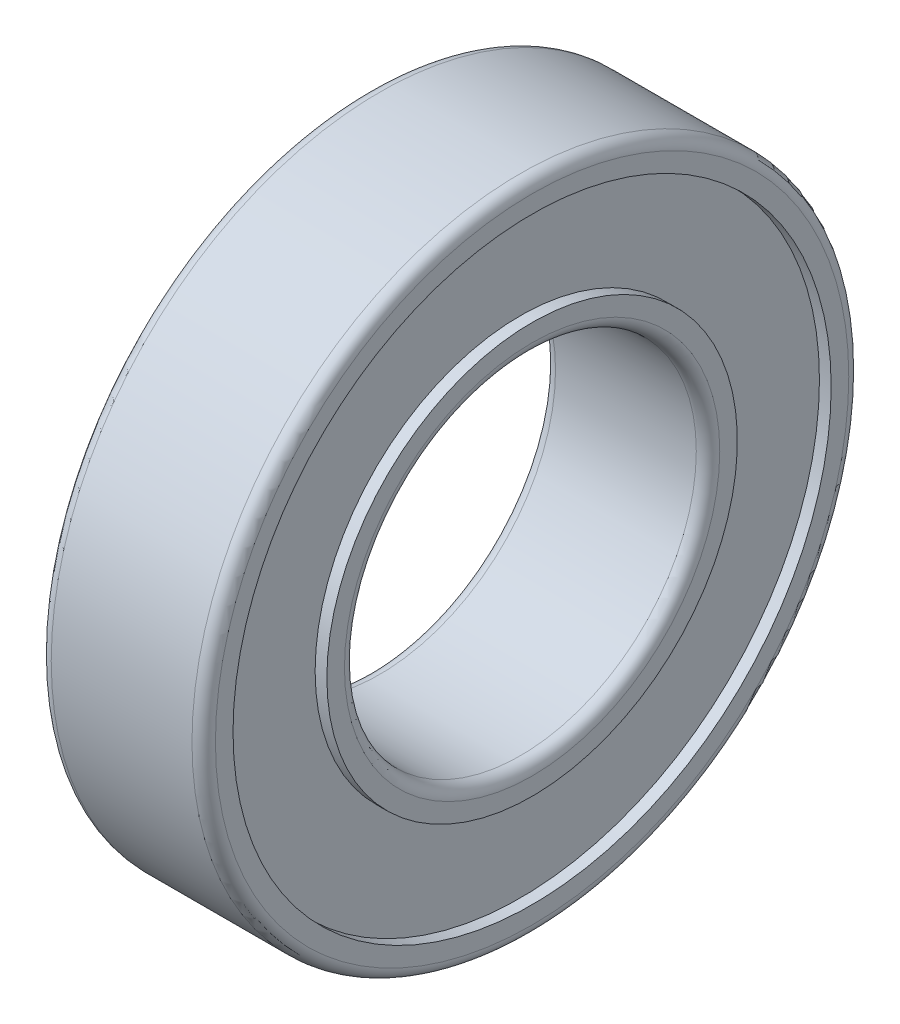
ISO-10303-21;
HEADER;
FILE_DESCRIPTION(('STEP AP214'),'2;1');
FILE_NAME('part.step','',(''),(''),'','','');
FILE_SCHEMA(('AUTOMOTIVE_DESIGN { 1 0 10303 214 1 1 1 1 }'));
ENDSEC;
DATA;
#1=APPLICATION_CONTEXT('core data for automotive mechanical design processes');
#2=APPLICATION_PROTOCOL_DEFINITION('international standard','automotive_design',2000,#1);
#3=PRODUCT_CONTEXT('',#1,'mechanical');
#4=PRODUCT('Part','Part','',(#3));
#5=PRODUCT_RELATED_PRODUCT_CATEGORY('part','',(#4));
#6=PRODUCT_DEFINITION_FORMATION('','',#4);
#7=PRODUCT_DEFINITION_CONTEXT('part definition',#1,'design');
#8=PRODUCT_DEFINITION('design','',#6,#7);
#9=PRODUCT_DEFINITION_SHAPE('','',#8);
#10=(LENGTH_UNIT() NAMED_UNIT(*) SI_UNIT(.MILLI.,.METRE.));
#11=(NAMED_UNIT(*) PLANE_ANGLE_UNIT() SI_UNIT($,.RADIAN.));
#12=(NAMED_UNIT(*) SI_UNIT($,.STERADIAN.) SOLID_ANGLE_UNIT());
#13=UNCERTAINTY_MEASURE_WITH_UNIT(LENGTH_MEASURE(1.E-05),#10,'distance_accuracy_value','');
#14=(GEOMETRIC_REPRESENTATION_CONTEXT(3) GLOBAL_UNCERTAINTY_ASSIGNED_CONTEXT((#13)) GLOBAL_UNIT_ASSIGNED_CONTEXT((#10,
#11,#12)) REPRESENTATION_CONTEXT('',''));
#15=CARTESIAN_POINT('',(0.,0.,0.));
#16=DIRECTION('',(0.,0.,1.));
#17=DIRECTION('',(1.,0.,0.));
#18=AXIS2_PLACEMENT_3D('',#15,#16,#17);
#19=CARTESIAN_POINT('',(0.5,12.75,0.));
#20=DIRECTION('',(1.,0.,0.));
#21=DIRECTION('',(0.,0.,-1.));
#22=AXIS2_PLACEMENT_3D('',#19,#20,#21);
#23=PLANE('',#22);
#24=CARTESIAN_POINT('',(0.5,0.,0.));
#25=DIRECTION('',(-1.,0.,0.));
#26=DIRECTION('',(0.,0.,1.));
#27=AXIS2_PLACEMENT_3D('',#24,#25,#26);
#28=CIRCLE('',#27,12.75);
#29=CARTESIAN_POINT('',(0.5,0.,12.75));
#30=VERTEX_POINT('',#29);
#31=EDGE_CURVE('E298',#30,#30,#28,.T.);
#32=ORIENTED_EDGE('',*,*,#31,.T.);
#33=EDGE_LOOP('',(#32));
#34=FACE_BOUND('',#33,.T.);
#35=CARTESIAN_POINT('',(0.5,0.,0.));
#36=DIRECTION('',(-1.,0.,0.));
#37=DIRECTION('',(0.,0.,1.));
#38=AXIS2_PLACEMENT_3D('',#35,#36,#37);
#39=CIRCLE('',#38,8.75);
#40=CARTESIAN_POINT('',(0.5,0.,8.75));
#41=VERTEX_POINT('',#40);
#42=EDGE_CURVE('E296',#41,#41,#39,.T.);
#43=ORIENTED_EDGE('',*,*,#42,.F.);
#44=EDGE_LOOP('',(#43));
#45=FACE_BOUND('',#44,.T.);
#46=ADVANCED_FACE('F17',(#34,#45),#23,.F.);
#47=CARTESIAN_POINT('',(0.,0.,0.));
#48=DIRECTION('',(-1.,0.,0.));
#49=DIRECTION('',(0.,0.,1.));
#50=AXIS2_PLACEMENT_3D('',#47,#48,#49);
#51=CYLINDRICAL_SURFACE('',#50,12.75);
#52=ORIENTED_EDGE('',*,*,#31,.F.);
#53=EDGE_LOOP('',(#52));
#54=FACE_BOUND('',#53,.T.);
#55=CARTESIAN_POINT('',(0.,0.,0.));
#56=DIRECTION('',(-1.,0.,0.));
#57=DIRECTION('',(0.,0.,1.));
#58=AXIS2_PLACEMENT_3D('',#55,#56,#57);
#59=CIRCLE('',#58,12.75);
#60=CARTESIAN_POINT('',(0.,0.,12.75));
#61=VERTEX_POINT('',#60);
#62=EDGE_CURVE('E293',#61,#61,#59,.T.);
#63=ORIENTED_EDGE('',*,*,#62,.T.);
#64=EDGE_LOOP('',(#63));
#65=FACE_BOUND('',#64,.T.);
#66=ADVANCED_FACE('F102',(#54,#65),#51,.F.);
#67=CARTESIAN_POINT('',(0.,0.,0.));
#68=DIRECTION('',(-1.,0.,0.));
#69=DIRECTION('',(0.,0.,1.));
#70=AXIS2_PLACEMENT_3D('',#67,#68,#69);
#71=CYLINDRICAL_SURFACE('',#70,8.75);
#72=CARTESIAN_POINT('',(0.,0.,0.));
#73=DIRECTION('',(-1.,0.,0.));
#74=DIRECTION('',(0.,0.,1.));
#75=AXIS2_PLACEMENT_3D('',#72,#73,#74);
#76=CIRCLE('',#75,8.75);
#77=CARTESIAN_POINT('',(0.,0.,8.75));
#78=VERTEX_POINT('',#77);
#79=EDGE_CURVE('E70',#78,#78,#76,.F.);
#80=ORIENTED_EDGE('',*,*,#79,.T.);
#81=EDGE_LOOP('',(#80));
#82=FACE_BOUND('',#81,.T.);
#83=ORIENTED_EDGE('',*,*,#42,.T.);
#84=EDGE_LOOP('',(#83));
#85=FACE_BOUND('',#84,.T.);
#86=ADVANCED_FACE('F90',(#82,#85),#71,.T.);
#87=CARTESIAN_POINT('',(0.,14.,0.));
#88=DIRECTION('',(1.,0.,0.));
#89=DIRECTION('',(0.,0.,-1.));
#90=AXIS2_PLACEMENT_3D('',#87,#88,#89);
#91=PLANE('',#90);
#92=ORIENTED_EDGE('',*,*,#62,.F.);
#93=EDGE_LOOP('',(#92));
#94=FACE_BOUND('',#93,.T.);
#95=CARTESIAN_POINT('',(0.,0.,0.));
#96=DIRECTION('',(1.,0.,0.));
#97=DIRECTION('',(0.,0.,-1.));
#98=AXIS2_PLACEMENT_3D('',#95,#96,#97);
#99=CIRCLE('',#98,13.5);
#100=CARTESIAN_POINT('',(0.,0.,-13.5));
#101=VERTEX_POINT('',#100);
#102=CARTESIAN_POINT('',(0.,0.,13.5));
#103=VERTEX_POINT('',#102);
#104=EDGE_CURVE('E57',#101,#103,#99,.T.);
#105=ORIENTED_EDGE('',*,*,#104,.F.);
#106=CARTESIAN_POINT('',(0.,0.,0.));
#107=DIRECTION('',(1.,0.,0.));
#108=DIRECTION('',(0.,0.,1.));
#109=AXIS2_PLACEMENT_3D('',#106,#107,#108);
#110=CIRCLE('',#109,13.5);
#111=EDGE_CURVE('E59',#103,#101,#110,.T.);
#112=ORIENTED_EDGE('',*,*,#111,.F.);
#113=EDGE_LOOP('',(#105,#112));
#114=FACE_BOUND('',#113,.T.);
#115=ADVANCED_FACE('F69',(#94,#114),#91,.F.);
#116=CARTESIAN_POINT('',(0.,8.75,0.));
#117=DIRECTION('',(1.,0.,0.));
#118=DIRECTION('',(0.,0.,-1.));
#119=AXIS2_PLACEMENT_3D('',#116,#117,#118);
#120=PLANE('',#119);
#121=ORIENTED_EDGE('',*,*,#79,.F.);
#122=EDGE_LOOP('',(#121));
#123=FACE_BOUND('',#122,.T.);
#124=CARTESIAN_POINT('',(0.,0.,0.));
#125=DIRECTION('',(-1.,0.,0.));
#126=DIRECTION('',(0.,0.,-1.));
#127=AXIS2_PLACEMENT_3D('',#124,#125,#126);
#128=CIRCLE('',#127,8.);
#129=CARTESIAN_POINT('',(0.,0.,-8.));
#130=VERTEX_POINT('',#129);
#131=CARTESIAN_POINT('',(0.,0.,8.));
#132=VERTEX_POINT('',#131);
#133=EDGE_CURVE('E65',#130,#132,#128,.T.);
#134=ORIENTED_EDGE('',*,*,#133,.F.);
#135=CARTESIAN_POINT('',(0.,0.,0.));
#136=DIRECTION('',(-1.,0.,0.));
#137=DIRECTION('',(0.,0.,1.));
#138=AXIS2_PLACEMENT_3D('',#135,#136,#137);
#139=CIRCLE('',#138,8.);
#140=EDGE_CURVE('E240',#132,#130,#139,.T.);
#141=ORIENTED_EDGE('',*,*,#140,.F.);
#142=EDGE_LOOP('',(#134,#141));
#143=FACE_BOUND('',#142,.T.);
#144=ADVANCED_FACE('F89',(#123,#143),#120,.F.);
#145=CARTESIAN_POINT('',(0.500000000000002,0.,0.));
#146=DIRECTION('',(1.,0.,0.));
#147=DIRECTION('',(0.,0.,-1.));
#148=AXIS2_PLACEMENT_3D('',#145,#146,#147);
#149=TOROIDAL_SURFACE('',#148,13.5,0.5);
#150=ORIENTED_EDGE('',*,*,#104,.T.);
#151=ORIENTED_EDGE('',*,*,#111,.T.);
#152=EDGE_LOOP('',(#150,#151));
#153=FACE_BOUND('',#152,.T.);
#154=CARTESIAN_POINT('',(0.500000000000002,0.,0.));
#155=DIRECTION('',(-1.,0.,0.));
#156=DIRECTION('',(0.,0.,1.));
#157=AXIS2_PLACEMENT_3D('',#154,#155,#156);
#158=CIRCLE('',#157,14.);
#159=CARTESIAN_POINT('',(0.500000000000002,0.,14.));
#160=VERTEX_POINT('',#159);
#161=EDGE_CURVE('E237',#160,#160,#158,.F.);
#162=ORIENTED_EDGE('',*,*,#161,.F.);
#163=EDGE_LOOP('',(#162));
#164=FACE_BOUND('',#163,.T.);
#165=ADVANCED_FACE('F61',(#153,#164),#149,.T.);
#166=CARTESIAN_POINT('',(0.5,0.,0.));
#167=DIRECTION('',(1.,0.,0.));
#168=DIRECTION('',(0.,0.,-1.));
#169=AXIS2_PLACEMENT_3D('',#166,#167,#168);
#170=TOROIDAL_SURFACE('',#169,8.,0.5);
#171=ORIENTED_EDGE('',*,*,#133,.T.);
#172=ORIENTED_EDGE('',*,*,#140,.T.);
#173=EDGE_LOOP('',(#171,#172));
#174=FACE_BOUND('',#173,.T.);
#175=CARTESIAN_POINT('',(0.5,0.,0.));
#176=DIRECTION('',(-1.,0.,0.));
#177=DIRECTION('',(0.,0.,1.));
#178=AXIS2_PLACEMENT_3D('',#175,#176,#177);
#179=CIRCLE('',#178,7.5);
#180=CARTESIAN_POINT('',(0.5,0.,7.5));
#181=VERTEX_POINT('',#180);
#182=EDGE_CURVE('E233',#181,#181,#179,.F.);
#183=ORIENTED_EDGE('',*,*,#182,.T.);
#184=EDGE_LOOP('',(#183));
#185=FACE_BOUND('',#184,.T.);
#186=ADVANCED_FACE('F217',(#174,#185),#170,.T.);
#187=CARTESIAN_POINT('',(0.,0.,0.));
#188=DIRECTION('',(-1.,0.,0.));
#189=DIRECTION('',(0.,0.,1.));
#190=AXIS2_PLACEMENT_3D('',#187,#188,#189);
#191=CYLINDRICAL_SURFACE('',#190,14.);
#192=CARTESIAN_POINT('',(6.5,0.,0.));
#193=DIRECTION('',(-1.,0.,0.));
#194=DIRECTION('',(0.,0.,1.));
#195=AXIS2_PLACEMENT_3D('',#192,#193,#194);
#196=CIRCLE('',#195,14.);
#197=CARTESIAN_POINT('',(6.5,0.,14.));
#198=VERTEX_POINT('',#197);
#199=EDGE_CURVE('E263',#198,#198,#196,.F.);
#200=ORIENTED_EDGE('',*,*,#199,.F.);
#201=EDGE_LOOP('',(#200));
#202=FACE_BOUND('',#201,.T.);
#203=ORIENTED_EDGE('',*,*,#161,.T.);
#204=EDGE_LOOP('',(#203));
#205=FACE_BOUND('',#204,.T.);
#206=ADVANCED_FACE('F227',(#202,#205),#191,.T.);
#207=CARTESIAN_POINT('',(0.,0.,0.));
#208=DIRECTION('',(-1.,0.,0.));
#209=DIRECTION('',(0.,0.,1.));
#210=AXIS2_PLACEMENT_3D('',#207,#208,#209);
#211=CYLINDRICAL_SURFACE('',#210,7.5);
#212=CARTESIAN_POINT('',(6.5,0.,0.));
#213=DIRECTION('',(-1.,0.,0.));
#214=DIRECTION('',(0.,0.,1.));
#215=AXIS2_PLACEMENT_3D('',#212,#213,#214);
#216=CIRCLE('',#215,7.5);
#217=CARTESIAN_POINT('',(6.5,0.,7.5));
#218=VERTEX_POINT('',#217);
#219=EDGE_CURVE('E265',#218,#218,#216,.T.);
#220=ORIENTED_EDGE('',*,*,#219,.F.);
#221=EDGE_LOOP('',(#220));
#222=FACE_BOUND('',#221,.T.);
#223=ORIENTED_EDGE('',*,*,#182,.F.);
#224=EDGE_LOOP('',(#223));
#225=FACE_BOUND('',#224,.T.);
#226=ADVANCED_FACE('F324',(#222,#225),#211,.F.);
#227=CARTESIAN_POINT('',(6.5,0.,0.));
#228=DIRECTION('',(-1.,0.,0.));
#229=DIRECTION('',(0.,0.,1.));
#230=AXIS2_PLACEMENT_3D('',#227,#228,#229);
#231=TOROIDAL_SURFACE('',#230,13.5,0.5);
#232=CARTESIAN_POINT('',(7.,0.,0.));
#233=DIRECTION('',(-1.,0.,0.));
#234=DIRECTION('',(0.,0.,1.));
#235=AXIS2_PLACEMENT_3D('',#232,#233,#234);
#236=CIRCLE('',#235,13.5);
#237=CARTESIAN_POINT('',(7.,0.,13.5));
#238=VERTEX_POINT('',#237);
#239=CARTESIAN_POINT('',(7.,0.,-13.5));
#240=VERTEX_POINT('',#239);
#241=EDGE_CURVE('E155',#238,#240,#236,.T.);
#242=ORIENTED_EDGE('',*,*,#241,.T.);
#243=CARTESIAN_POINT('',(7.,0.,0.));
#244=DIRECTION('',(-1.,0.,0.));
#245=DIRECTION('',(0.,0.,-1.));
#246=AXIS2_PLACEMENT_3D('',#243,#244,#245);
#247=CIRCLE('',#246,13.5);
#248=EDGE_CURVE('E166',#240,#238,#247,.T.);
#249=ORIENTED_EDGE('',*,*,#248,.T.);
#250=EDGE_LOOP('',(#242,#249));
#251=FACE_BOUND('',#250,.T.);
#252=ORIENTED_EDGE('',*,*,#199,.T.);
#253=EDGE_LOOP('',(#252));
#254=FACE_BOUND('',#253,.T.);
#255=ADVANCED_FACE('F182',(#251,#254),#231,.T.);
#256=CARTESIAN_POINT('',(6.5,0.,0.));
#257=DIRECTION('',(-1.,0.,0.));
#258=DIRECTION('',(0.,0.,1.));
#259=AXIS2_PLACEMENT_3D('',#256,#257,#258);
#260=TOROIDAL_SURFACE('',#259,8.,0.5);
#261=CARTESIAN_POINT('',(7.,0.,0.));
#262=DIRECTION('',(1.,0.,0.));
#263=DIRECTION('',(0.,0.,1.));
#264=AXIS2_PLACEMENT_3D('',#261,#262,#263);
#265=CIRCLE('',#264,8.);
#266=CARTESIAN_POINT('',(7.,0.,8.));
#267=VERTEX_POINT('',#266);
#268=CARTESIAN_POINT('',(7.,0.,-8.));
#269=VERTEX_POINT('',#268);
#270=EDGE_CURVE('E280',#267,#269,#265,.T.);
#271=ORIENTED_EDGE('',*,*,#270,.T.);
#272=CARTESIAN_POINT('',(7.,0.,0.));
#273=DIRECTION('',(1.,0.,0.));
#274=DIRECTION('',(0.,0.,-1.));
#275=AXIS2_PLACEMENT_3D('',#272,#273,#274);
#276=CIRCLE('',#275,8.);
#277=EDGE_CURVE('E36',#269,#267,#276,.T.);
#278=ORIENTED_EDGE('',*,*,#277,.T.);
#279=EDGE_LOOP('',(#271,#278));
#280=FACE_BOUND('',#279,.T.);
#281=ORIENTED_EDGE('',*,*,#219,.T.);
#282=EDGE_LOOP('',(#281));
#283=FACE_BOUND('',#282,.T.);
#284=ADVANCED_FACE('F178',(#280,#283),#260,.T.);
#285=CARTESIAN_POINT('',(7.,12.75,0.));
#286=DIRECTION('',(-1.,0.,0.));
#287=DIRECTION('',(0.,0.,1.));
#288=AXIS2_PLACEMENT_3D('',#285,#286,#287);
#289=PLANE('',#288);
#290=CARTESIAN_POINT('',(7.,0.,0.));
#291=DIRECTION('',(-1.,0.,0.));
#292=DIRECTION('',(0.,0.,1.));
#293=AXIS2_PLACEMENT_3D('',#290,#291,#292);
#294=CIRCLE('',#293,12.75);
#295=CARTESIAN_POINT('',(7.,0.,12.75));
#296=VERTEX_POINT('',#295);
#297=EDGE_CURVE('E281',#296,#296,#294,.T.);
#298=ORIENTED_EDGE('',*,*,#297,.T.);
#299=EDGE_LOOP('',(#298));
#300=FACE_BOUND('',#299,.T.);
#301=ORIENTED_EDGE('',*,*,#241,.F.);
#302=ORIENTED_EDGE('',*,*,#248,.F.);
#303=EDGE_LOOP('',(#301,#302));
#304=FACE_BOUND('',#303,.T.);
#305=ADVANCED_FACE('F134',(#300,#304),#289,.F.);
#306=CARTESIAN_POINT('',(7.,7.5,0.));
#307=DIRECTION('',(-1.,0.,0.));
#308=DIRECTION('',(0.,0.,1.));
#309=AXIS2_PLACEMENT_3D('',#306,#307,#308);
#310=PLANE('',#309);
#311=CARTESIAN_POINT('',(7.,0.,0.));
#312=DIRECTION('',(-1.,0.,0.));
#313=DIRECTION('',(0.,0.,1.));
#314=AXIS2_PLACEMENT_3D('',#311,#312,#313);
#315=CIRCLE('',#314,8.75);
#316=CARTESIAN_POINT('',(7.,0.,8.75));
#317=VERTEX_POINT('',#316);
#318=EDGE_CURVE('E283',#317,#317,#315,.T.);
#319=ORIENTED_EDGE('',*,*,#318,.F.);
#320=EDGE_LOOP('',(#319));
#321=FACE_BOUND('',#320,.T.);
#322=ORIENTED_EDGE('',*,*,#270,.F.);
#323=ORIENTED_EDGE('',*,*,#277,.F.);
#324=EDGE_LOOP('',(#322,#323));
#325=FACE_BOUND('',#324,.T.);
#326=ADVANCED_FACE('F129',(#321,#325),#310,.F.);
#327=CARTESIAN_POINT('',(0.,0.,0.));
#328=DIRECTION('',(-1.,0.,0.));
#329=DIRECTION('',(0.,0.,1.));
#330=AXIS2_PLACEMENT_3D('',#327,#328,#329);
#331=CYLINDRICAL_SURFACE('',#330,12.75);
#332=ORIENTED_EDGE('',*,*,#297,.F.);
#333=EDGE_LOOP('',(#332));
#334=FACE_BOUND('',#333,.T.);
#335=CARTESIAN_POINT('',(6.5,0.,0.));
#336=DIRECTION('',(-1.,0.,0.));
#337=DIRECTION('',(0.,0.,1.));
#338=AXIS2_PLACEMENT_3D('',#335,#336,#337);
#339=CIRCLE('',#338,12.75);
#340=CARTESIAN_POINT('',(6.5,0.,12.75));
#341=VERTEX_POINT('',#340);
#342=EDGE_CURVE('E28',#341,#341,#339,.T.);
#343=ORIENTED_EDGE('',*,*,#342,.T.);
#344=EDGE_LOOP('',(#343));
#345=FACE_BOUND('',#344,.T.);
#346=ADVANCED_FACE('F121',(#334,#345),#331,.F.);
#347=CARTESIAN_POINT('',(0.,0.,0.));
#348=DIRECTION('',(-1.,0.,0.));
#349=DIRECTION('',(0.,0.,1.));
#350=AXIS2_PLACEMENT_3D('',#347,#348,#349);
#351=CYLINDRICAL_SURFACE('',#350,8.75);
#352=CARTESIAN_POINT('',(6.5,0.,0.));
#353=DIRECTION('',(-1.,0.,0.));
#354=DIRECTION('',(0.,0.,1.));
#355=AXIS2_PLACEMENT_3D('',#352,#353,#354);
#356=CIRCLE('',#355,8.75);
#357=CARTESIAN_POINT('',(6.5,0.,8.75));
#358=VERTEX_POINT('',#357);
#359=EDGE_CURVE('E11',#358,#358,#356,.F.);
#360=ORIENTED_EDGE('',*,*,#359,.T.);
#361=EDGE_LOOP('',(#360));
#362=FACE_BOUND('',#361,.T.);
#363=ORIENTED_EDGE('',*,*,#318,.T.);
#364=EDGE_LOOP('',(#363));
#365=FACE_BOUND('',#364,.T.);
#366=ADVANCED_FACE('F115',(#362,#365),#351,.T.);
#367=CARTESIAN_POINT('',(6.5,8.75,0.));
#368=DIRECTION('',(-1.,0.,0.));
#369=DIRECTION('',(0.,0.,1.));
#370=AXIS2_PLACEMENT_3D('',#367,#368,#369);
#371=PLANE('',#370);
#372=ORIENTED_EDGE('',*,*,#359,.F.);
#373=EDGE_LOOP('',(#372));
#374=FACE_BOUND('',#373,.T.);
#375=ORIENTED_EDGE('',*,*,#342,.F.);
#376=EDGE_LOOP('',(#375));
#377=FACE_BOUND('',#376,.T.);
#378=ADVANCED_FACE('F113',(#374,#377),#371,.F.);
#379=CLOSED_SHELL('',(#46,#66,#86,#115,#144,#165,#186,#206,#226,#255,#284,#305,#326,#346,#366,#378));
#380=MANIFOLD_SOLID_BREP('B1',#379);
#381=ADVANCED_BREP_SHAPE_REPRESENTATION('',(#18,#380),#14);
#382=SHAPE_DEFINITION_REPRESENTATION(#9,#381);
ENDSEC;
END-ISO-10303-21;
